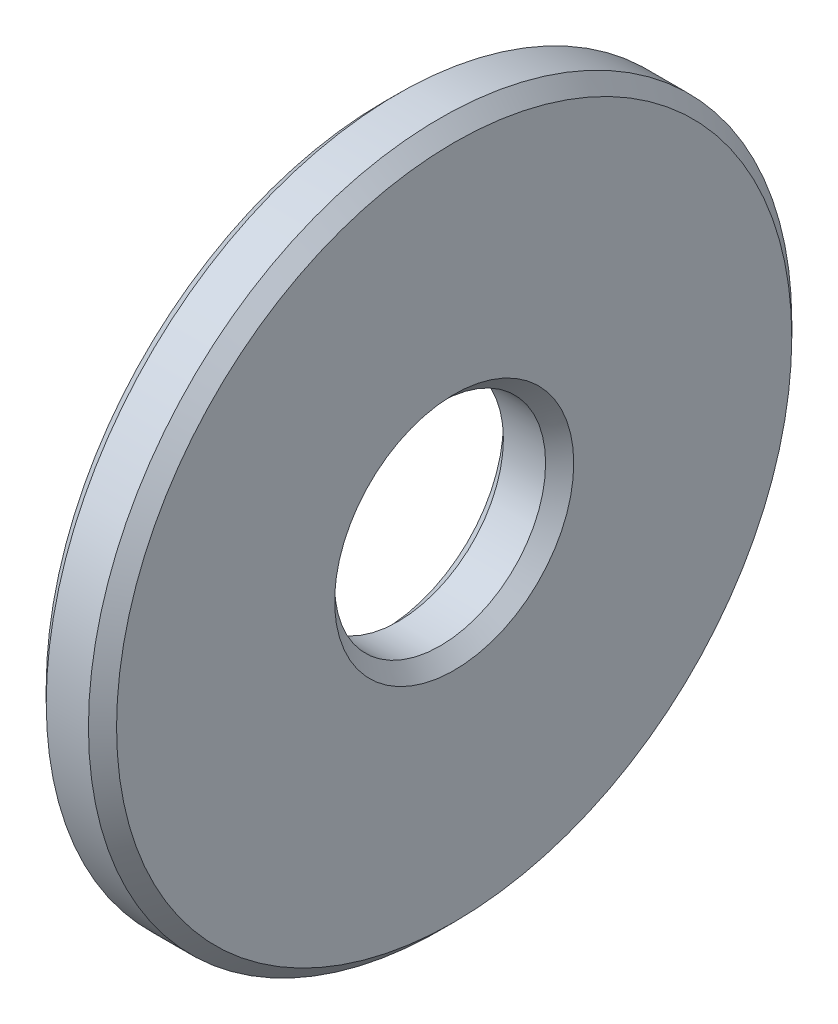
ISO-10303-21;
HEADER;
FILE_DESCRIPTION(('STEP AP214'),'2;1');
FILE_NAME('part.step','',(''),(''),'','','');
FILE_SCHEMA(('AUTOMOTIVE_DESIGN { 1 0 10303 214 1 1 1 1 }'));
ENDSEC;
DATA;
#1=APPLICATION_CONTEXT('core data for automotive mechanical design processes');
#2=APPLICATION_PROTOCOL_DEFINITION('international standard','automotive_design',2000,#1);
#3=PRODUCT_CONTEXT('',#1,'mechanical');
#4=PRODUCT('Part','Part','',(#3));
#5=PRODUCT_RELATED_PRODUCT_CATEGORY('part','',(#4));
#6=PRODUCT_DEFINITION_FORMATION('','',#4);
#7=PRODUCT_DEFINITION_CONTEXT('part definition',#1,'design');
#8=PRODUCT_DEFINITION('design','',#6,#7);
#9=PRODUCT_DEFINITION_SHAPE('','',#8);
#10=(LENGTH_UNIT() NAMED_UNIT(*) SI_UNIT(.MILLI.,.METRE.));
#11=(NAMED_UNIT(*) PLANE_ANGLE_UNIT() SI_UNIT($,.RADIAN.));
#12=(NAMED_UNIT(*) SI_UNIT($,.STERADIAN.) SOLID_ANGLE_UNIT());
#13=UNCERTAINTY_MEASURE_WITH_UNIT(LENGTH_MEASURE(1.E-05),#10,'distance_accuracy_value','');
#14=(GEOMETRIC_REPRESENTATION_CONTEXT(3) GLOBAL_UNCERTAINTY_ASSIGNED_CONTEXT((#13)) GLOBAL_UNIT_ASSIGNED_CONTEXT((#10,
#11,#12)) REPRESENTATION_CONTEXT('',''));
#15=CARTESIAN_POINT('',(0.,0.,0.));
#16=DIRECTION('',(0.,0.,1.));
#17=DIRECTION('',(1.,0.,0.));
#18=AXIS2_PLACEMENT_3D('',#15,#16,#17);
#19=CARTESIAN_POINT('',(0.2,0.,0.));
#20=DIRECTION('',(1.,0.,0.));
#21=DIRECTION('',(0.,0.,-1.));
#22=AXIS2_PLACEMENT_3D('',#19,#20,#21);
#23=CONICAL_SURFACE('',#22,5.,0.78539816339745);
#24=CARTESIAN_POINT('',(0.,0.,0.));
#25=DIRECTION('',(1.,0.,0.));
#26=DIRECTION('',(0.,0.,-1.));
#27=AXIS2_PLACEMENT_3D('',#24,#25,#26);
#28=CIRCLE('',#27,4.8);
#29=CARTESIAN_POINT('',(0.,0.,-4.8));
#30=VERTEX_POINT('',#29);
#31=EDGE_CURVE('E10',#30,#30,#28,.T.);
#32=ORIENTED_EDGE('',*,*,#31,.T.);
#33=EDGE_LOOP('',(#32));
#34=FACE_BOUND('',#33,.T.);
#35=CARTESIAN_POINT('',(0.2,0.,0.));
#36=DIRECTION('',(1.,0.,0.));
#37=DIRECTION('',(0.,0.,-1.));
#38=AXIS2_PLACEMENT_3D('',#35,#36,#37);
#39=CIRCLE('',#38,5.);
#40=CARTESIAN_POINT('',(0.2,0.,-5.));
#41=VERTEX_POINT('',#40);
#42=EDGE_CURVE('E59',#41,#41,#39,.T.);
#43=ORIENTED_EDGE('',*,*,#42,.F.);
#44=EDGE_LOOP('',(#43));
#45=FACE_BOUND('',#44,.T.);
#46=ADVANCED_FACE('F31',(#34,#45),#23,.T.);
#47=CARTESIAN_POINT('',(0.,4.8,0.));
#48=DIRECTION('',(-1.,0.,0.));
#49=DIRECTION('',(0.,0.,1.));
#50=AXIS2_PLACEMENT_3D('',#47,#48,#49);
#51=PLANE('',#50);
#52=CARTESIAN_POINT('',(0.,0.,0.));
#53=DIRECTION('',(1.,0.,0.));
#54=DIRECTION('',(0.,0.,-1.));
#55=AXIS2_PLACEMENT_3D('',#52,#53,#54);
#56=CIRCLE('',#55,1.7);
#57=CARTESIAN_POINT('',(0.,0.,-1.7));
#58=VERTEX_POINT('',#57);
#59=EDGE_CURVE('E37',#58,#58,#56,.T.);
#60=ORIENTED_EDGE('',*,*,#59,.T.);
#61=EDGE_LOOP('',(#60));
#62=FACE_BOUND('',#61,.T.);
#63=ORIENTED_EDGE('',*,*,#31,.F.);
#64=EDGE_LOOP('',(#63));
#65=FACE_BOUND('',#64,.T.);
#66=ADVANCED_FACE('F67',(#62,#65),#51,.T.);
#67=CARTESIAN_POINT('',(0.,0.,0.));
#68=DIRECTION('',(-1.,0.,0.));
#69=DIRECTION('',(0.,0.,1.));
#70=AXIS2_PLACEMENT_3D('',#67,#68,#69);
#71=CONICAL_SURFACE('',#70,1.7,0.785398163397448);
#72=CARTESIAN_POINT('',(0.2,0.,0.));
#73=DIRECTION('',(1.,0.,0.));
#74=DIRECTION('',(0.,0.,-1.));
#75=AXIS2_PLACEMENT_3D('',#72,#73,#74);
#76=CIRCLE('',#75,1.5);
#77=CARTESIAN_POINT('',(0.2,0.,-1.5));
#78=VERTEX_POINT('',#77);
#79=EDGE_CURVE('E41',#78,#78,#76,.T.);
#80=ORIENTED_EDGE('',*,*,#79,.T.);
#81=EDGE_LOOP('',(#80));
#82=FACE_BOUND('',#81,.T.);
#83=ORIENTED_EDGE('',*,*,#59,.F.);
#84=EDGE_LOOP('',(#83));
#85=FACE_BOUND('',#84,.T.);
#86=ADVANCED_FACE('F71',(#82,#85),#71,.F.);
#87=CARTESIAN_POINT('',(0.,0.,0.));
#88=DIRECTION('',(1.,0.,0.));
#89=DIRECTION('',(0.,0.,-1.));
#90=AXIS2_PLACEMENT_3D('',#87,#88,#89);
#91=CYLINDRICAL_SURFACE('',#90,1.5);
#92=CARTESIAN_POINT('',(0.8,0.,0.));
#93=DIRECTION('',(1.,0.,0.));
#94=DIRECTION('',(0.,0.,-1.));
#95=AXIS2_PLACEMENT_3D('',#92,#93,#94);
#96=CIRCLE('',#95,1.5);
#97=CARTESIAN_POINT('',(0.8,0.,-1.5));
#98=VERTEX_POINT('',#97);
#99=EDGE_CURVE('E45',#98,#98,#96,.T.);
#100=ORIENTED_EDGE('',*,*,#99,.T.);
#101=EDGE_LOOP('',(#100));
#102=FACE_BOUND('',#101,.T.);
#103=ORIENTED_EDGE('',*,*,#79,.F.);
#104=EDGE_LOOP('',(#103));
#105=FACE_BOUND('',#104,.T.);
#106=ADVANCED_FACE('F75',(#102,#105),#91,.F.);
#107=CARTESIAN_POINT('',(0.8,0.,0.));
#108=DIRECTION('',(1.,0.,0.));
#109=DIRECTION('',(0.,0.,-1.));
#110=AXIS2_PLACEMENT_3D('',#107,#108,#109);
#111=CONICAL_SURFACE('',#110,1.5,0.785398163397447);
#112=CARTESIAN_POINT('',(1.,0.,0.));
#113=DIRECTION('',(1.,0.,0.));
#114=DIRECTION('',(0.,0.,-1.));
#115=AXIS2_PLACEMENT_3D('',#112,#113,#114);
#116=CIRCLE('',#115,1.7);
#117=CARTESIAN_POINT('',(1.,0.,-1.7));
#118=VERTEX_POINT('',#117);
#119=EDGE_CURVE('E50',#118,#118,#116,.T.);
#120=ORIENTED_EDGE('',*,*,#119,.T.);
#121=EDGE_LOOP('',(#120));
#122=FACE_BOUND('',#121,.T.);
#123=ORIENTED_EDGE('',*,*,#99,.F.);
#124=EDGE_LOOP('',(#123));
#125=FACE_BOUND('',#124,.T.);
#126=ADVANCED_FACE('F82',(#122,#125),#111,.F.);
#127=CARTESIAN_POINT('',(1.,1.7,0.));
#128=DIRECTION('',(1.,0.,0.));
#129=DIRECTION('',(0.,0.,-1.));
#130=AXIS2_PLACEMENT_3D('',#127,#128,#129);
#131=PLANE('',#130);
#132=CARTESIAN_POINT('',(1.,0.,0.));
#133=DIRECTION('',(1.,0.,0.));
#134=DIRECTION('',(0.,0.,-1.));
#135=AXIS2_PLACEMENT_3D('',#132,#133,#134);
#136=CIRCLE('',#135,4.8);
#137=CARTESIAN_POINT('',(1.,0.,-4.8));
#138=VERTEX_POINT('',#137);
#139=EDGE_CURVE('E53',#138,#138,#136,.T.);
#140=ORIENTED_EDGE('',*,*,#139,.T.);
#141=EDGE_LOOP('',(#140));
#142=FACE_BOUND('',#141,.T.);
#143=ORIENTED_EDGE('',*,*,#119,.F.);
#144=EDGE_LOOP('',(#143));
#145=FACE_BOUND('',#144,.T.);
#146=ADVANCED_FACE('F86',(#142,#145),#131,.T.);
#147=CARTESIAN_POINT('',(1.,0.,0.));
#148=DIRECTION('',(-1.,0.,0.));
#149=DIRECTION('',(0.,0.,1.));
#150=AXIS2_PLACEMENT_3D('',#147,#148,#149);
#151=CONICAL_SURFACE('',#150,4.8,0.785398163397448);
#152=CARTESIAN_POINT('',(0.8,0.,0.));
#153=DIRECTION('',(1.,0.,0.));
#154=DIRECTION('',(0.,0.,-1.));
#155=AXIS2_PLACEMENT_3D('',#152,#153,#154);
#156=CIRCLE('',#155,5.);
#157=CARTESIAN_POINT('',(0.8,0.,-5.));
#158=VERTEX_POINT('',#157);
#159=EDGE_CURVE('E56',#158,#158,#156,.T.);
#160=ORIENTED_EDGE('',*,*,#159,.T.);
#161=EDGE_LOOP('',(#160));
#162=FACE_BOUND('',#161,.T.);
#163=ORIENTED_EDGE('',*,*,#139,.F.);
#164=EDGE_LOOP('',(#163));
#165=FACE_BOUND('',#164,.T.);
#166=ADVANCED_FACE('F90',(#162,#165),#151,.T.);
#167=CARTESIAN_POINT('',(0.,0.,0.));
#168=DIRECTION('',(1.,0.,0.));
#169=DIRECTION('',(0.,0.,-1.));
#170=AXIS2_PLACEMENT_3D('',#167,#168,#169);
#171=CYLINDRICAL_SURFACE('',#170,5.);
#172=ORIENTED_EDGE('',*,*,#42,.T.);
#173=EDGE_LOOP('',(#172));
#174=FACE_BOUND('',#173,.T.);
#175=ORIENTED_EDGE('',*,*,#159,.F.);
#176=EDGE_LOOP('',(#175));
#177=FACE_BOUND('',#176,.T.);
#178=ADVANCED_FACE('F63',(#174,#177),#171,.T.);
#179=CLOSED_SHELL('',(#46,#66,#86,#106,#126,#146,#166,#178));
#180=MANIFOLD_SOLID_BREP('B2',#179);
#181=ADVANCED_BREP_SHAPE_REPRESENTATION('',(#18,#180),#14);
#182=SHAPE_DEFINITION_REPRESENTATION(#9,#181);
ENDSEC;
END-ISO-10303-21;
